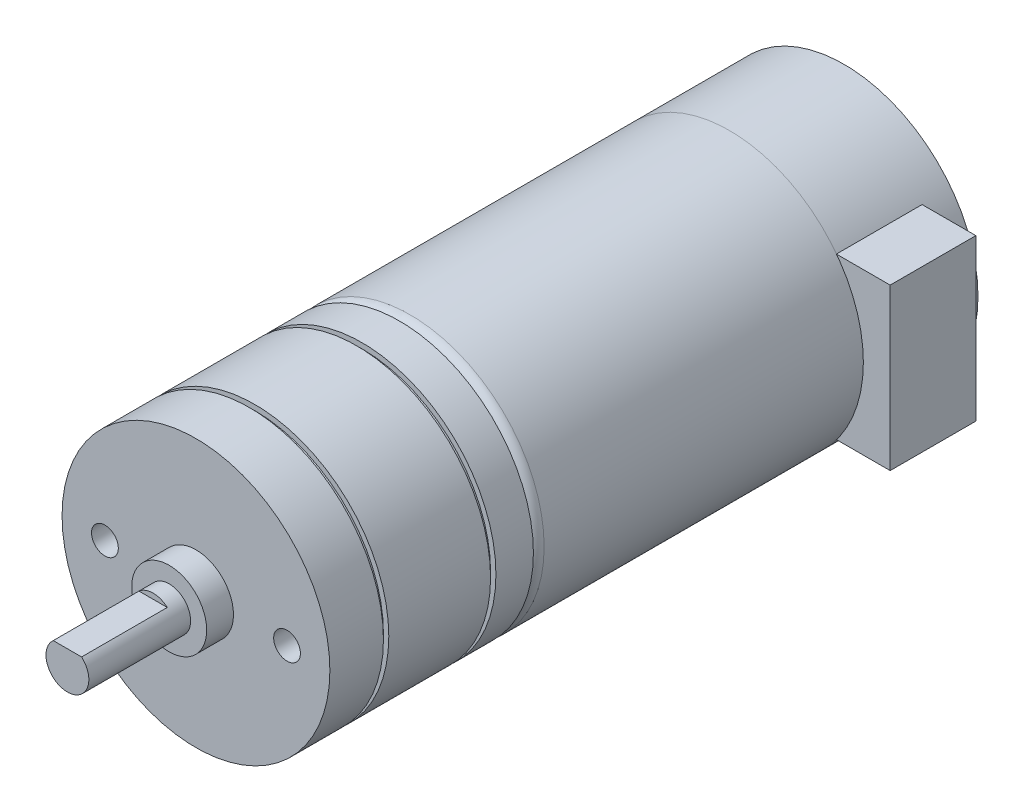
ISO-10303-21;
HEADER;
FILE_DESCRIPTION(('STEP AP214'),'2;1');
FILE_NAME('part.step','',(''),(''),'','','');
FILE_SCHEMA(('AUTOMOTIVE_DESIGN { 1 0 10303 214 1 1 1 1 }'));
ENDSEC;
DATA;
#1=APPLICATION_CONTEXT('core data for automotive mechanical design processes');
#2=APPLICATION_PROTOCOL_DEFINITION('international standard','automotive_design',2000,#1);
#3=PRODUCT_CONTEXT('',#1,'mechanical');
#4=PRODUCT('Part','Part','',(#3));
#5=PRODUCT_RELATED_PRODUCT_CATEGORY('part','',(#4));
#6=PRODUCT_DEFINITION_FORMATION('','',#4);
#7=PRODUCT_DEFINITION_CONTEXT('part definition',#1,'design');
#8=PRODUCT_DEFINITION('design','',#6,#7);
#9=PRODUCT_DEFINITION_SHAPE('','',#8);
#10=(LENGTH_UNIT() NAMED_UNIT(*) SI_UNIT(.MILLI.,.METRE.));
#11=(NAMED_UNIT(*) PLANE_ANGLE_UNIT() SI_UNIT($,.RADIAN.));
#12=(NAMED_UNIT(*) SI_UNIT($,.STERADIAN.) SOLID_ANGLE_UNIT());
#13=UNCERTAINTY_MEASURE_WITH_UNIT(LENGTH_MEASURE(1.E-05),#10,'distance_accuracy_value','');
#14=(GEOMETRIC_REPRESENTATION_CONTEXT(3) GLOBAL_UNCERTAINTY_ASSIGNED_CONTEXT((#13)) GLOBAL_UNIT_ASSIGNED_CONTEXT((#10,
#11,#12)) REPRESENTATION_CONTEXT('',''));
#15=CARTESIAN_POINT('',(0.,0.,0.));
#16=DIRECTION('',(0.,0.,1.));
#17=DIRECTION('',(1.,0.,0.));
#18=AXIS2_PLACEMENT_3D('',#15,#16,#17);
#19=CARTESIAN_POINT('',(0.,0.,52.3));
#20=DIRECTION('',(0.,0.,-1.));
#21=DIRECTION('',(-1.,0.,0.));
#22=AXIS2_PLACEMENT_3D('',#19,#20,#21);
#23=CYLINDRICAL_SURFACE('',#22,3.5);
#24=CARTESIAN_POINT('',(0.,0.,52.3));
#25=DIRECTION('',(0.,0.,1.));
#26=DIRECTION('',(1.,0.,0.));
#27=AXIS2_PLACEMENT_3D('',#24,#25,#26);
#28=CIRCLE('',#27,3.5);
#29=CARTESIAN_POINT('',(3.5,0.,52.3));
#30=VERTEX_POINT('',#29);
#31=EDGE_CURVE('E53',#30,#30,#28,.T.);
#32=ORIENTED_EDGE('',*,*,#31,.F.);
#33=EDGE_LOOP('',(#32));
#34=FACE_BOUND('',#33,.T.);
#35=CARTESIAN_POINT('',(0.,0.,49.8));
#36=DIRECTION('',(0.,0.,1.));
#37=DIRECTION('',(1.,0.,0.));
#38=AXIS2_PLACEMENT_3D('',#35,#36,#37);
#39=CIRCLE('',#38,3.5);
#40=CARTESIAN_POINT('',(3.5,0.,49.8));
#41=VERTEX_POINT('',#40);
#42=EDGE_CURVE('E48',#41,#41,#39,.T.);
#43=ORIENTED_EDGE('',*,*,#42,.T.);
#44=EDGE_LOOP('',(#43));
#45=FACE_BOUND('',#44,.T.);
#46=ADVANCED_FACE('F45',(#34,#45),#23,.T.);
#47=CARTESIAN_POINT('',(0.,0.,52.3));
#48=DIRECTION('',(0.,0.,1.));
#49=DIRECTION('',(1.,0.,0.));
#50=AXIS2_PLACEMENT_3D('',#47,#48,#49);
#51=PLANE('',#50);
#52=CARTESIAN_POINT('',(0.,0.,52.3));
#53=DIRECTION('',(0.,0.,1.));
#54=DIRECTION('',(1.,0.,0.));
#55=AXIS2_PLACEMENT_3D('',#52,#53,#54);
#56=CIRCLE('',#55,2.);
#57=CARTESIAN_POINT('',(2.,0.,52.3));
#58=VERTEX_POINT('',#57);
#59=EDGE_CURVE('E12',#58,#58,#56,.T.);
#60=ORIENTED_EDGE('',*,*,#59,.F.);
#61=EDGE_LOOP('',(#60));
#62=FACE_BOUND('',#61,.T.);
#63=ORIENTED_EDGE('',*,*,#31,.T.);
#64=EDGE_LOOP('',(#63));
#65=FACE_BOUND('',#64,.T.);
#66=ADVANCED_FACE('F92',(#62,#65),#51,.T.);
#67=CARTESIAN_POINT('',(0.,0.,49.8));
#68=DIRECTION('',(0.,0.,1.));
#69=DIRECTION('',(1.,0.,0.));
#70=AXIS2_PLACEMENT_3D('',#67,#68,#69);
#71=PLANE('',#70);
#72=ORIENTED_EDGE('',*,*,#42,.F.);
#73=EDGE_LOOP('',(#72));
#74=FACE_BOUND('',#73,.T.);
#75=ADVANCED_FACE('F98',(#74),#71,.F.);
#76=CARTESIAN_POINT('',(0.,0.,61.8));
#77=DIRECTION('',(0.,0.,-1.));
#78=DIRECTION('',(-1.,0.,0.));
#79=AXIS2_PLACEMENT_3D('',#76,#77,#78);
#80=CYLINDRICAL_SURFACE('',#79,2.);
#81=CARTESIAN_POINT('',(0.,0.,61.8));
#82=DIRECTION('',(0.,0.,1.));
#83=DIRECTION('',(1.,0.,0.));
#84=AXIS2_PLACEMENT_3D('',#81,#82,#83);
#85=CIRCLE('',#84,2.);
#86=CARTESIAN_POINT('',(-1.3228756555323,1.5,61.8));
#87=VERTEX_POINT('',#86);
#88=CARTESIAN_POINT('',(1.3228756555323,1.5,61.8));
#89=VERTEX_POINT('',#88);
#90=EDGE_CURVE('E83',#87,#89,#85,.T.);
#91=ORIENTED_EDGE('',*,*,#90,.F.);
#92=DIRECTION('',(0.,0.,1.));
#93=VECTOR('',#92,1.);
#94=CARTESIAN_POINT('',(-1.3228756555323,1.5,53.8));
#95=LINE('',#94,#93);
#96=CARTESIAN_POINT('',(-1.3228756555323,1.5,53.8));
#97=VERTEX_POINT('',#96);
#98=EDGE_CURVE('E61',#97,#87,#95,.T.);
#99=ORIENTED_EDGE('',*,*,#98,.F.);
#100=CARTESIAN_POINT('',(0.,0.,53.8));
#101=DIRECTION('',(0.,0.,1.));
#102=DIRECTION('',(1.,0.,0.));
#103=AXIS2_PLACEMENT_3D('',#100,#101,#102);
#104=CIRCLE('',#103,2.);
#105=CARTESIAN_POINT('',(1.3228756555323,1.5,53.8));
#106=VERTEX_POINT('',#105);
#107=EDGE_CURVE('E77',#106,#97,#104,.T.);
#108=ORIENTED_EDGE('',*,*,#107,.F.);
#109=DIRECTION('',(0.,0.,1.));
#110=VECTOR('',#109,1.);
#111=CARTESIAN_POINT('',(1.3228756555323,1.5,53.8));
#112=LINE('',#111,#110);
#113=EDGE_CURVE('E67',#106,#89,#112,.T.);
#114=ORIENTED_EDGE('',*,*,#113,.T.);
#115=EDGE_LOOP('',(#91,#99,#108,#114));
#116=FACE_BOUND('',#115,.T.);
#117=ORIENTED_EDGE('',*,*,#59,.T.);
#118=EDGE_LOOP('',(#117));
#119=FACE_BOUND('',#118,.T.);
#120=ADVANCED_FACE('F81',(#116,#119),#80,.T.);
#121=CARTESIAN_POINT('',(0.,0.,61.8));
#122=DIRECTION('',(0.,0.,1.));
#123=DIRECTION('',(1.,0.,0.));
#124=AXIS2_PLACEMENT_3D('',#121,#122,#123);
#125=PLANE('',#124);
#126=DIRECTION('',(1.,0.,0.));
#127=VECTOR('',#126,1.);
#128=CARTESIAN_POINT('',(0.,1.5,61.8));
#129=LINE('',#128,#127);
#130=EDGE_CURVE('E72',#87,#89,#129,.T.);
#131=ORIENTED_EDGE('',*,*,#130,.F.);
#132=ORIENTED_EDGE('',*,*,#90,.T.);
#133=EDGE_LOOP('',(#131,#132));
#134=FACE_BOUND('',#133,.T.);
#135=ADVANCED_FACE('F85',(#134),#125,.T.);
#136=CARTESIAN_POINT('',(0.,1.5,53.8));
#137=DIRECTION('',(0.,-1.,0.));
#138=DIRECTION('',(0.,0.,-1.));
#139=AXIS2_PLACEMENT_3D('',#136,#137,#138);
#140=PLANE('',#139);
#141=ORIENTED_EDGE('',*,*,#130,.T.);
#142=ORIENTED_EDGE('',*,*,#113,.F.);
#143=DIRECTION('',(1.,0.,0.));
#144=VECTOR('',#143,1.);
#145=CARTESIAN_POINT('',(0.,1.5,53.8));
#146=LINE('',#145,#144);
#147=EDGE_CURVE('E117',#97,#106,#146,.T.);
#148=ORIENTED_EDGE('',*,*,#147,.F.);
#149=ORIENTED_EDGE('',*,*,#98,.T.);
#150=EDGE_LOOP('',(#141,#142,#148,#149));
#151=FACE_BOUND('',#150,.T.);
#152=ADVANCED_FACE('F73',(#151),#140,.F.);
#153=CARTESIAN_POINT('',(0.,0.,53.8));
#154=DIRECTION('',(0.,0.,1.));
#155=DIRECTION('',(1.,0.,0.));
#156=AXIS2_PLACEMENT_3D('',#153,#154,#155);
#157=PLANE('',#156);
#158=ORIENTED_EDGE('',*,*,#107,.T.);
#159=ORIENTED_EDGE('',*,*,#147,.T.);
#160=EDGE_LOOP('',(#158,#159));
#161=FACE_BOUND('',#160,.T.);
#162=ADVANCED_FACE('F112',(#161),#157,.T.);
#163=CLOSED_SHELL('',(#46,#66,#75,#120,#135,#152,#162));
#164=MANIFOLD_SOLID_BREP('B2',#163);
#165=CARTESIAN_POINT('',(0.,0.,49.8));
#166=DIRECTION('',(0.,0.,-1.));
#167=DIRECTION('',(-1.,0.,0.));
#168=AXIS2_PLACEMENT_3D('',#165,#166,#167);
#169=CYLINDRICAL_SURFACE('',#168,12.5);
#170=CARTESIAN_POINT('',(0.,0.,34.8));
#171=DIRECTION('',(0.,0.,1.));
#172=DIRECTION('',(1.,0.,0.));
#173=AXIS2_PLACEMENT_3D('',#170,#171,#172);
#174=CIRCLE('',#173,12.5);
#175=CARTESIAN_POINT('',(12.5,0.,34.8));
#176=VERTEX_POINT('',#175);
#177=EDGE_CURVE('E222',#176,#176,#174,.T.);
#178=ORIENTED_EDGE('',*,*,#177,.T.);
#179=EDGE_LOOP('',(#178));
#180=FACE_BOUND('',#179,.T.);
#181=CARTESIAN_POINT('',(0.,0.,44.3));
#182=DIRECTION('',(0.,0.,1.));
#183=DIRECTION('',(1.,0.,0.));
#184=AXIS2_PLACEMENT_3D('',#181,#182,#183);
#185=CIRCLE('',#184,12.5);
#186=CARTESIAN_POINT('',(12.5,0.,44.3));
#187=VERTEX_POINT('',#186);
#188=EDGE_CURVE('E213',#187,#187,#185,.T.);
#189=ORIENTED_EDGE('',*,*,#188,.F.);
#190=EDGE_LOOP('',(#189));
#191=FACE_BOUND('',#190,.T.);
#192=ADVANCED_FACE('F171',(#180,#191),#169,.T.);
#193=CARTESIAN_POINT('',(0.,0.,30.8));
#194=DIRECTION('',(0.,0.,1.));
#195=DIRECTION('',(1.,0.,0.));
#196=AXIS2_PLACEMENT_3D('',#193,#194,#195);
#197=CIRCLE('',#196,12.5);
#198=CARTESIAN_POINT('',(12.5,0.,30.8));
#199=VERTEX_POINT('',#198);
#200=EDGE_CURVE('E175',#199,#199,#197,.T.);
#201=ORIENTED_EDGE('',*,*,#200,.T.);
#202=EDGE_LOOP('',(#201));
#203=FACE_BOUND('',#202,.T.);
#204=CARTESIAN_POINT('',(0.,0.,34.3));
#205=DIRECTION('',(0.,0.,1.));
#206=DIRECTION('',(1.,0.,0.));
#207=AXIS2_PLACEMENT_3D('',#204,#205,#206);
#208=CIRCLE('',#207,12.5);
#209=CARTESIAN_POINT('',(12.5,0.,34.3));
#210=VERTEX_POINT('',#209);
#211=EDGE_CURVE('E225',#210,#210,#208,.T.);
#212=ORIENTED_EDGE('',*,*,#211,.F.);
#213=EDGE_LOOP('',(#212));
#214=FACE_BOUND('',#213,.T.);
#215=ADVANCED_FACE('F251',(#203,#214),#169,.T.);
#216=CARTESIAN_POINT('',(0.,0.,30.8));
#217=DIRECTION('',(0.,0.,1.));
#218=DIRECTION('',(1.,0.,0.));
#219=AXIS2_PLACEMENT_3D('',#216,#217,#218);
#220=PLANE('',#219);
#221=ORIENTED_EDGE('',*,*,#200,.F.);
#222=EDGE_LOOP('',(#221));
#223=FACE_BOUND('',#222,.T.);
#224=ADVANCED_FACE('F246',(#223),#220,.F.);
#225=CARTESIAN_POINT('',(0.,0.,34.3));
#226=DIRECTION('',(0.,0.,1.));
#227=DIRECTION('',(1.,0.,0.));
#228=AXIS2_PLACEMENT_3D('',#225,#226,#227);
#229=PLANE('',#228);
#230=CARTESIAN_POINT('',(0.,0.,34.3));
#231=DIRECTION('',(0.,0.,1.));
#232=DIRECTION('',(1.,0.,0.));
#233=AXIS2_PLACEMENT_3D('',#230,#231,#232);
#234=CIRCLE('',#233,12.);
#235=CARTESIAN_POINT('',(12.,0.,34.3));
#236=VERTEX_POINT('',#235);
#237=EDGE_CURVE('E219',#236,#236,#234,.T.);
#238=ORIENTED_EDGE('',*,*,#237,.F.);
#239=EDGE_LOOP('',(#238));
#240=FACE_BOUND('',#239,.T.);
#241=ORIENTED_EDGE('',*,*,#211,.T.);
#242=EDGE_LOOP('',(#241));
#243=FACE_BOUND('',#242,.T.);
#244=ADVANCED_FACE('F236',(#240,#243),#229,.T.);
#245=CARTESIAN_POINT('',(0.,0.,34.8));
#246=DIRECTION('',(0.,0.,1.));
#247=DIRECTION('',(1.,0.,0.));
#248=AXIS2_PLACEMENT_3D('',#245,#246,#247);
#249=PLANE('',#248);
#250=CARTESIAN_POINT('',(0.,0.,34.8));
#251=DIRECTION('',(0.,0.,1.));
#252=DIRECTION('',(1.,0.,0.));
#253=AXIS2_PLACEMENT_3D('',#250,#251,#252);
#254=CIRCLE('',#253,12.);
#255=CARTESIAN_POINT('',(12.,0.,34.8));
#256=VERTEX_POINT('',#255);
#257=EDGE_CURVE('E216',#256,#256,#254,.T.);
#258=ORIENTED_EDGE('',*,*,#257,.T.);
#259=EDGE_LOOP('',(#258));
#260=FACE_BOUND('',#259,.T.);
#261=ORIENTED_EDGE('',*,*,#177,.F.);
#262=EDGE_LOOP('',(#261));
#263=FACE_BOUND('',#262,.T.);
#264=ADVANCED_FACE('F233',(#260,#263),#249,.F.);
#265=CARTESIAN_POINT('',(0.,0.,34.3));
#266=DIRECTION('',(0.,0.,1.));
#267=DIRECTION('',(1.,0.,0.));
#268=AXIS2_PLACEMENT_3D('',#265,#266,#267);
#269=CYLINDRICAL_SURFACE('',#268,12.);
#270=ORIENTED_EDGE('',*,*,#237,.T.);
#271=EDGE_LOOP('',(#270));
#272=FACE_BOUND('',#271,.T.);
#273=ORIENTED_EDGE('',*,*,#257,.F.);
#274=EDGE_LOOP('',(#273));
#275=FACE_BOUND('',#274,.T.);
#276=ADVANCED_FACE('F235',(#272,#275),#269,.T.);
#277=CARTESIAN_POINT('',(0.,0.,44.3));
#278=DIRECTION('',(0.,0.,1.));
#279=DIRECTION('',(1.,0.,0.));
#280=AXIS2_PLACEMENT_3D('',#277,#278,#279);
#281=PLANE('',#280);
#282=CARTESIAN_POINT('',(0.,0.,44.3));
#283=DIRECTION('',(0.,0.,1.));
#284=DIRECTION('',(1.,0.,0.));
#285=AXIS2_PLACEMENT_3D('',#282,#283,#284);
#286=CIRCLE('',#285,12.);
#287=CARTESIAN_POINT('',(12.,0.,44.3));
#288=VERTEX_POINT('',#287);
#289=EDGE_CURVE('E207',#288,#288,#286,.T.);
#290=ORIENTED_EDGE('',*,*,#289,.F.);
#291=EDGE_LOOP('',(#290));
#292=FACE_BOUND('',#291,.T.);
#293=ORIENTED_EDGE('',*,*,#188,.T.);
#294=EDGE_LOOP('',(#293));
#295=FACE_BOUND('',#294,.T.);
#296=ADVANCED_FACE('F243',(#292,#295),#281,.T.);
#297=CARTESIAN_POINT('',(0.,0.,44.8));
#298=DIRECTION('',(0.,0.,1.));
#299=DIRECTION('',(1.,0.,0.));
#300=AXIS2_PLACEMENT_3D('',#297,#298,#299);
#301=PLANE('',#300);
#302=CARTESIAN_POINT('',(0.,0.,44.8));
#303=DIRECTION('',(0.,0.,1.));
#304=DIRECTION('',(1.,0.,0.));
#305=AXIS2_PLACEMENT_3D('',#302,#303,#304);
#306=CIRCLE('',#305,12.);
#307=CARTESIAN_POINT('',(12.,0.,44.8));
#308=VERTEX_POINT('',#307);
#309=EDGE_CURVE('E206',#308,#308,#306,.T.);
#310=ORIENTED_EDGE('',*,*,#309,.T.);
#311=EDGE_LOOP('',(#310));
#312=FACE_BOUND('',#311,.T.);
#313=CARTESIAN_POINT('',(0.,0.,44.8));
#314=DIRECTION('',(0.,0.,1.));
#315=DIRECTION('',(1.,0.,0.));
#316=AXIS2_PLACEMENT_3D('',#313,#314,#315);
#317=CIRCLE('',#316,12.5);
#318=CARTESIAN_POINT('',(12.5,0.,44.8));
#319=VERTEX_POINT('',#318);
#320=EDGE_CURVE('E210',#319,#319,#317,.T.);
#321=ORIENTED_EDGE('',*,*,#320,.F.);
#322=EDGE_LOOP('',(#321));
#323=FACE_BOUND('',#322,.T.);
#324=ADVANCED_FACE('F272',(#312,#323),#301,.F.);
#325=CARTESIAN_POINT('',(0.,0.,44.3));
#326=DIRECTION('',(0.,0.,1.));
#327=DIRECTION('',(1.,0.,0.));
#328=AXIS2_PLACEMENT_3D('',#325,#326,#327);
#329=CYLINDRICAL_SURFACE('',#328,12.);
#330=ORIENTED_EDGE('',*,*,#289,.T.);
#331=EDGE_LOOP('',(#330));
#332=FACE_BOUND('',#331,.T.);
#333=ORIENTED_EDGE('',*,*,#309,.F.);
#334=EDGE_LOOP('',(#333));
#335=FACE_BOUND('',#334,.T.);
#336=ADVANCED_FACE('F265',(#332,#335),#329,.T.);
#337=CARTESIAN_POINT('',(0.,0.,49.8));
#338=DIRECTION('',(0.,0.,1.));
#339=DIRECTION('',(1.,0.,0.));
#340=AXIS2_PLACEMENT_3D('',#337,#338,#339);
#341=PLANE('',#340);
#342=CARTESIAN_POINT('',(-8.5,0.,49.8));
#343=DIRECTION('',(0.,0.,1.));
#344=DIRECTION('',(1.,0.,0.));
#345=AXIS2_PLACEMENT_3D('',#342,#343,#344);
#346=CIRCLE('',#345,1.24999999999999);
#347=CARTESIAN_POINT('',(-7.25000000000001,0.,49.8));
#348=VERTEX_POINT('',#347);
#349=EDGE_CURVE('E196',#348,#348,#346,.T.);
#350=ORIENTED_EDGE('',*,*,#349,.F.);
#351=EDGE_LOOP('',(#350));
#352=FACE_BOUND('',#351,.T.);
#353=CARTESIAN_POINT('',(8.5,0.,49.8));
#354=DIRECTION('',(0.,0.,1.));
#355=DIRECTION('',(1.,0.,0.));
#356=AXIS2_PLACEMENT_3D('',#353,#354,#355);
#357=CIRCLE('',#356,1.24999999999999);
#358=CARTESIAN_POINT('',(9.74999999999999,0.,49.8));
#359=VERTEX_POINT('',#358);
#360=EDGE_CURVE('E195',#359,#359,#357,.T.);
#361=ORIENTED_EDGE('',*,*,#360,.F.);
#362=EDGE_LOOP('',(#361));
#363=FACE_BOUND('',#362,.T.);
#364=CARTESIAN_POINT('',(0.,0.,49.8));
#365=DIRECTION('',(0.,0.,1.));
#366=DIRECTION('',(1.,0.,0.));
#367=AXIS2_PLACEMENT_3D('',#364,#365,#366);
#368=CIRCLE('',#367,12.5);
#369=CARTESIAN_POINT('',(12.5,0.,49.8));
#370=VERTEX_POINT('',#369);
#371=EDGE_CURVE('E43',#370,#370,#368,.T.);
#372=ORIENTED_EDGE('',*,*,#371,.T.);
#373=EDGE_LOOP('',(#372));
#374=FACE_BOUND('',#373,.T.);
#375=ADVANCED_FACE('F258',(#352,#363,#374),#341,.T.);
#376=ORIENTED_EDGE('',*,*,#320,.T.);
#377=EDGE_LOOP('',(#376));
#378=FACE_BOUND('',#377,.T.);
#379=ORIENTED_EDGE('',*,*,#371,.F.);
#380=EDGE_LOOP('',(#379));
#381=FACE_BOUND('',#380,.T.);
#382=ADVANCED_FACE('F173',(#378,#381),#169,.T.);
#383=CARTESIAN_POINT('',(8.5,0.,44.8));
#384=DIRECTION('',(0.,0.,1.));
#385=DIRECTION('',(1.,0.,0.));
#386=AXIS2_PLACEMENT_3D('',#383,#384,#385);
#387=CONICAL_SURFACE('',#386,1.25,1.02974425867665);
#388=CARTESIAN_POINT('',(8.5,0.,44.0489242262155));
#389=VERTEX_POINT('',#388);
#390=VERTEX_LOOP('',#389);
#391=FACE_BOUND('',#390,.T.);
#392=CARTESIAN_POINT('',(8.5,0.,44.8));
#393=DIRECTION('',(0.,0.,1.));
#394=DIRECTION('',(1.,0.,0.));
#395=AXIS2_PLACEMENT_3D('',#392,#393,#394);
#396=CIRCLE('',#395,1.25);
#397=CARTESIAN_POINT('',(9.75,0.,44.8));
#398=VERTEX_POINT('',#397);
#399=EDGE_CURVE('E199',#398,#398,#396,.T.);
#400=ORIENTED_EDGE('',*,*,#399,.T.);
#401=EDGE_LOOP('',(#400));
#402=FACE_BOUND('',#401,.T.);
#403=ADVANCED_FACE('F257',(#391,#402),#387,.F.);
#404=CARTESIAN_POINT('',(8.5,0.,49.8));
#405=DIRECTION('',(0.,0.,1.));
#406=DIRECTION('',(1.,0.,0.));
#407=AXIS2_PLACEMENT_3D('',#404,#405,#406);
#408=CYLINDRICAL_SURFACE('',#407,1.24999999999999);
#409=ORIENTED_EDGE('',*,*,#399,.F.);
#410=EDGE_LOOP('',(#409));
#411=FACE_BOUND('',#410,.T.);
#412=ORIENTED_EDGE('',*,*,#360,.T.);
#413=EDGE_LOOP('',(#412));
#414=FACE_BOUND('',#413,.T.);
#415=ADVANCED_FACE('F189',(#411,#414),#408,.F.);
#416=CARTESIAN_POINT('',(-8.5,0.,44.8));
#417=DIRECTION('',(0.,0.,1.));
#418=DIRECTION('',(1.,0.,0.));
#419=AXIS2_PLACEMENT_3D('',#416,#417,#418);
#420=CONICAL_SURFACE('',#419,1.25,1.02974425867665);
#421=CARTESIAN_POINT('',(-8.5,0.,44.0489242262155));
#422=VERTEX_POINT('',#421);
#423=VERTEX_LOOP('',#422);
#424=FACE_BOUND('',#423,.T.);
#425=CARTESIAN_POINT('',(-8.5,0.,44.8));
#426=DIRECTION('',(0.,0.,1.));
#427=DIRECTION('',(1.,0.,0.));
#428=AXIS2_PLACEMENT_3D('',#425,#426,#427);
#429=CIRCLE('',#428,1.25);
#430=CARTESIAN_POINT('',(-7.25,0.,44.8));
#431=VERTEX_POINT('',#430);
#432=EDGE_CURVE('E193',#431,#431,#429,.T.);
#433=ORIENTED_EDGE('',*,*,#432,.T.);
#434=EDGE_LOOP('',(#433));
#435=FACE_BOUND('',#434,.T.);
#436=ADVANCED_FACE('F185',(#424,#435),#420,.F.);
#437=CARTESIAN_POINT('',(-8.5,0.,49.8));
#438=DIRECTION('',(0.,0.,1.));
#439=DIRECTION('',(1.,0.,0.));
#440=AXIS2_PLACEMENT_3D('',#437,#438,#439);
#441=CYLINDRICAL_SURFACE('',#440,1.24999999999999);
#442=ORIENTED_EDGE('',*,*,#432,.F.);
#443=EDGE_LOOP('',(#442));
#444=FACE_BOUND('',#443,.T.);
#445=ORIENTED_EDGE('',*,*,#349,.T.);
#446=EDGE_LOOP('',(#445));
#447=FACE_BOUND('',#446,.T.);
#448=ADVANCED_FACE('F188',(#444,#447),#441,.F.);
#449=CLOSED_SHELL('',(#192,#215,#224,#244,#264,#276,#296,#324,#336,#375,#382,#403,#415,#436,#448));
#450=MANIFOLD_SOLID_BREP('B6',#449);
#451=CARTESIAN_POINT('',(15.,-7.5,0.));
#452=DIRECTION('',(0.,0.,-1.));
#453=DIRECTION('',(-1.,0.,0.));
#454=AXIS2_PLACEMENT_3D('',#451,#452,#453);
#455=PLANE('',#454);
#456=DIRECTION('',(0.,-1.,0.));
#457=VECTOR('',#456,1.);
#458=CARTESIAN_POINT('',(0.,-7.5,0.));
#459=LINE('',#458,#457);
#460=CARTESIAN_POINT('',(0.,7.5,0.));
#461=VERTEX_POINT('',#460);
#462=CARTESIAN_POINT('',(0.,-7.5,0.));
#463=VERTEX_POINT('',#462);
#464=EDGE_CURVE('E466',#461,#463,#459,.T.);
#465=ORIENTED_EDGE('',*,*,#464,.T.);
#466=DIRECTION('',(-1.,0.,0.));
#467=VECTOR('',#466,1.);
#468=CARTESIAN_POINT('',(15.,-7.5,0.));
#469=LINE('',#468,#467);
#470=CARTESIAN_POINT('',(15.,-7.5,0.));
#471=VERTEX_POINT('',#470);
#472=EDGE_CURVE('E169',#471,#463,#469,.T.);
#473=ORIENTED_EDGE('',*,*,#472,.F.);
#474=DIRECTION('',(0.,-1.,0.));
#475=VECTOR('',#474,1.);
#476=CARTESIAN_POINT('',(15.,-7.5,0.));
#477=LINE('',#476,#475);
#478=CARTESIAN_POINT('',(15.,7.5,0.));
#479=VERTEX_POINT('',#478);
#480=EDGE_CURVE('E454',#479,#471,#477,.T.);
#481=ORIENTED_EDGE('',*,*,#480,.F.);
#482=DIRECTION('',(-1.,0.,0.));
#483=VECTOR('',#482,1.);
#484=CARTESIAN_POINT('',(15.,7.5,0.));
#485=LINE('',#484,#483);
#486=EDGE_CURVE('E462',#479,#461,#485,.T.);
#487=ORIENTED_EDGE('',*,*,#486,.T.);
#488=EDGE_LOOP('',(#465,#473,#481,#487));
#489=FACE_BOUND('',#488,.T.);
#490=ADVANCED_FACE('F403',(#489),#455,.F.);
#491=CARTESIAN_POINT('',(15.,-7.5,0.));
#492=DIRECTION('',(0.,1.,0.));
#493=DIRECTION('',(0.,0.,1.));
#494=AXIS2_PLACEMENT_3D('',#491,#492,#493);
#495=PLANE('',#494);
#496=DIRECTION('',(0.,0.,-1.));
#497=VECTOR('',#496,1.);
#498=CARTESIAN_POINT('',(0.,-7.5,0.));
#499=LINE('',#498,#497);
#500=CARTESIAN_POINT('',(0.,-7.5,-8.));
#501=VERTEX_POINT('',#500);
#502=EDGE_CURVE('E458',#463,#501,#499,.T.);
#503=ORIENTED_EDGE('',*,*,#502,.T.);
#504=DIRECTION('',(-1.,0.,0.));
#505=VECTOR('',#504,1.);
#506=CARTESIAN_POINT('',(15.,-7.5,-8.));
#507=LINE('',#506,#505);
#508=CARTESIAN_POINT('',(15.,-7.5,-8.));
#509=VERTEX_POINT('',#508);
#510=EDGE_CURVE('E411',#509,#501,#507,.T.);
#511=ORIENTED_EDGE('',*,*,#510,.F.);
#512=DIRECTION('',(0.,0.,-1.));
#513=VECTOR('',#512,1.);
#514=CARTESIAN_POINT('',(15.,-7.5,0.));
#515=LINE('',#514,#513);
#516=EDGE_CURVE('E449',#471,#509,#515,.T.);
#517=ORIENTED_EDGE('',*,*,#516,.F.);
#518=ORIENTED_EDGE('',*,*,#472,.T.);
#519=EDGE_LOOP('',(#503,#511,#517,#518));
#520=FACE_BOUND('',#519,.T.);
#521=ADVANCED_FACE('F457',(#520),#495,.F.);
#522=CARTESIAN_POINT('',(15.,-7.5,-8.));
#523=DIRECTION('',(0.,0.,1.));
#524=DIRECTION('',(1.,0.,0.));
#525=AXIS2_PLACEMENT_3D('',#522,#523,#524);
#526=PLANE('',#525);
#527=DIRECTION('',(0.,1.,0.));
#528=VECTOR('',#527,1.);
#529=CARTESIAN_POINT('',(0.,-7.5,-8.));
#530=LINE('',#529,#528);
#531=CARTESIAN_POINT('',(0.,7.5,-8.));
#532=VERTEX_POINT('',#531);
#533=EDGE_CURVE('E436',#501,#532,#530,.T.);
#534=ORIENTED_EDGE('',*,*,#533,.T.);
#535=DIRECTION('',(-1.,0.,0.));
#536=VECTOR('',#535,1.);
#537=CARTESIAN_POINT('',(15.,7.5,-8.));
#538=LINE('',#537,#536);
#539=CARTESIAN_POINT('',(15.,7.5,-8.));
#540=VERTEX_POINT('',#539);
#541=EDGE_CURVE('E459',#540,#532,#538,.T.);
#542=ORIENTED_EDGE('',*,*,#541,.F.);
#543=DIRECTION('',(0.,1.,0.));
#544=VECTOR('',#543,1.);
#545=CARTESIAN_POINT('',(15.,-7.5,-8.));
#546=LINE('',#545,#544);
#547=EDGE_CURVE('E452',#509,#540,#546,.T.);
#548=ORIENTED_EDGE('',*,*,#547,.F.);
#549=ORIENTED_EDGE('',*,*,#510,.T.);
#550=EDGE_LOOP('',(#534,#542,#548,#549));
#551=FACE_BOUND('',#550,.T.);
#552=ADVANCED_FACE('F460',(#551),#526,.F.);
#553=CARTESIAN_POINT('',(15.,7.5,0.));
#554=DIRECTION('',(0.,-1.,0.));
#555=DIRECTION('',(0.,0.,-1.));
#556=AXIS2_PLACEMENT_3D('',#553,#554,#555);
#557=PLANE('',#556);
#558=DIRECTION('',(0.,0.,1.));
#559=VECTOR('',#558,1.);
#560=CARTESIAN_POINT('',(0.,7.5,0.));
#561=LINE('',#560,#559);
#562=EDGE_CURVE('E442',#532,#461,#561,.T.);
#563=ORIENTED_EDGE('',*,*,#562,.T.);
#564=ORIENTED_EDGE('',*,*,#486,.F.);
#565=DIRECTION('',(0.,0.,1.));
#566=VECTOR('',#565,1.);
#567=CARTESIAN_POINT('',(15.,7.5,0.));
#568=LINE('',#567,#566);
#569=EDGE_CURVE('E419',#540,#479,#568,.T.);
#570=ORIENTED_EDGE('',*,*,#569,.F.);
#571=ORIENTED_EDGE('',*,*,#541,.T.);
#572=EDGE_LOOP('',(#563,#564,#570,#571));
#573=FACE_BOUND('',#572,.T.);
#574=ADVANCED_FACE('F473',(#573),#557,.F.);
#575=CARTESIAN_POINT('',(15.,0.,0.));
#576=DIRECTION('',(-1.,0.,0.));
#577=DIRECTION('',(0.,0.,1.));
#578=AXIS2_PLACEMENT_3D('',#575,#576,#577);
#579=PLANE('',#578);
#580=ORIENTED_EDGE('',*,*,#480,.T.);
#581=ORIENTED_EDGE('',*,*,#516,.T.);
#582=ORIENTED_EDGE('',*,*,#547,.T.);
#583=ORIENTED_EDGE('',*,*,#569,.T.);
#584=EDGE_LOOP('',(#580,#581,#582,#583));
#585=FACE_BOUND('',#584,.T.);
#586=ADVANCED_FACE('F450',(#585),#579,.F.);
#587=CARTESIAN_POINT('',(0.,0.,0.));
#588=DIRECTION('',(-1.,0.,0.));
#589=DIRECTION('',(0.,0.,1.));
#590=AXIS2_PLACEMENT_3D('',#587,#588,#589);
#591=PLANE('',#590);
#592=ORIENTED_EDGE('',*,*,#464,.F.);
#593=ORIENTED_EDGE('',*,*,#562,.F.);
#594=ORIENTED_EDGE('',*,*,#533,.F.);
#595=ORIENTED_EDGE('',*,*,#502,.F.);
#596=EDGE_LOOP('',(#592,#593,#594,#595));
#597=FACE_BOUND('',#596,.T.);
#598=ADVANCED_FACE('F476',(#597),#591,.T.);
#599=CLOSED_SHELL('',(#490,#521,#552,#574,#586,#598));
#600=MANIFOLD_SOLID_BREP('B37',#599);
#601=CARTESIAN_POINT('',(0.,0.,-10.7));
#602=DIRECTION('',(0.,0.,1.));
#603=DIRECTION('',(1.,0.,0.));
#604=AXIS2_PLACEMENT_3D('',#601,#602,#603);
#605=CYLINDRICAL_SURFACE('',#604,12.5);
#606=CARTESIAN_POINT('',(0.,0.,-10.7));
#607=DIRECTION('',(0.,0.,-1.));
#608=DIRECTION('',(-1.,0.,0.));
#609=AXIS2_PLACEMENT_3D('',#606,#607,#608);
#610=CIRCLE('',#609,12.5);
#611=CARTESIAN_POINT('',(-12.5,0.,-10.7));
#612=VERTEX_POINT('',#611);
#613=EDGE_CURVE('E402',#612,#612,#610,.T.);
#614=ORIENTED_EDGE('',*,*,#613,.F.);
#615=EDGE_LOOP('',(#614));
#616=FACE_BOUND('',#615,.T.);
#617=CARTESIAN_POINT('',(0.,0.,0.));
#618=DIRECTION('',(0.,0.,-1.));
#619=DIRECTION('',(-1.,0.,0.));
#620=AXIS2_PLACEMENT_3D('',#617,#618,#619);
#621=CIRCLE('',#620,12.5);
#622=CARTESIAN_POINT('',(-12.5,0.,0.));
#623=VERTEX_POINT('',#622);
#624=EDGE_CURVE('E536',#623,#623,#621,.T.);
#625=ORIENTED_EDGE('',*,*,#624,.T.);
#626=EDGE_LOOP('',(#625));
#627=FACE_BOUND('',#626,.T.);
#628=ADVANCED_FACE('F533',(#616,#627),#605,.T.);
#629=CARTESIAN_POINT('',(0.,0.,-10.7));
#630=DIRECTION('',(0.,0.,-1.));
#631=DIRECTION('',(-1.,0.,0.));
#632=AXIS2_PLACEMENT_3D('',#629,#630,#631);
#633=PLANE('',#632);
#634=ORIENTED_EDGE('',*,*,#613,.T.);
#635=EDGE_LOOP('',(#634));
#636=FACE_BOUND('',#635,.T.);
#637=ADVANCED_FACE('F548',(#636),#633,.T.);
#638=CARTESIAN_POINT('',(0.,0.,0.));
#639=DIRECTION('',(0.,0.,-1.));
#640=DIRECTION('',(-1.,0.,0.));
#641=AXIS2_PLACEMENT_3D('',#638,#639,#640);
#642=PLANE('',#641);
#643=ORIENTED_EDGE('',*,*,#624,.F.);
#644=EDGE_LOOP('',(#643));
#645=FACE_BOUND('',#644,.T.);
#646=ADVANCED_FACE('F546',(#645),#642,.F.);
#647=CLOSED_SHELL('',(#628,#637,#646));
#648=MANIFOLD_SOLID_BREP('B163',#647);
#649=CARTESIAN_POINT('',(0.,0.,30.8));
#650=DIRECTION('',(0.,0.,-1.));
#651=DIRECTION('',(-1.,0.,0.));
#652=AXIS2_PLACEMENT_3D('',#649,#650,#651);
#653=CYLINDRICAL_SURFACE('',#652,12.5);
#654=CARTESIAN_POINT('',(0.,0.,29.8));
#655=DIRECTION('',(0.,0.,1.));
#656=DIRECTION('',(1.,0.,0.));
#657=AXIS2_PLACEMENT_3D('',#654,#655,#656);
#658=CIRCLE('',#657,12.5);
#659=CARTESIAN_POINT('',(12.5,0.,29.8));
#660=VERTEX_POINT('',#659);
#661=EDGE_CURVE('E532',#660,#660,#658,.F.);
#662=ORIENTED_EDGE('',*,*,#661,.T.);
#663=EDGE_LOOP('',(#662));
#664=FACE_BOUND('',#663,.T.);
#665=CARTESIAN_POINT('',(0.,0.,0.));
#666=DIRECTION('',(0.,0.,1.));
#667=DIRECTION('',(1.,0.,0.));
#668=AXIS2_PLACEMENT_3D('',#665,#666,#667);
#669=CIRCLE('',#668,12.5);
#670=CARTESIAN_POINT('',(12.5,0.,0.));
#671=VERTEX_POINT('',#670);
#672=EDGE_CURVE('E584',#671,#671,#669,.T.);
#673=ORIENTED_EDGE('',*,*,#672,.T.);
#674=EDGE_LOOP('',(#673));
#675=FACE_BOUND('',#674,.T.);
#676=ADVANCED_FACE('F573',(#664,#675),#653,.T.);
#677=CARTESIAN_POINT('',(0.,0.,30.8));
#678=DIRECTION('',(0.,0.,1.));
#679=DIRECTION('',(1.,0.,0.));
#680=AXIS2_PLACEMENT_3D('',#677,#678,#679);
#681=PLANE('',#680);
#682=CARTESIAN_POINT('',(0.,0.,30.8));
#683=DIRECTION('',(0.,0.,1.));
#684=DIRECTION('',(1.,0.,0.));
#685=AXIS2_PLACEMENT_3D('',#682,#683,#684);
#686=CIRCLE('',#685,11.5);
#687=CARTESIAN_POINT('',(11.5,0.,30.8));
#688=VERTEX_POINT('',#687);
#689=EDGE_CURVE('E580',#688,#688,#686,.T.);
#690=ORIENTED_EDGE('',*,*,#689,.T.);
#691=EDGE_LOOP('',(#690));
#692=FACE_BOUND('',#691,.T.);
#693=ADVANCED_FACE('F594',(#692),#681,.T.);
#694=CARTESIAN_POINT('',(0.,0.,0.));
#695=DIRECTION('',(0.,0.,1.));
#696=DIRECTION('',(1.,0.,0.));
#697=AXIS2_PLACEMENT_3D('',#694,#695,#696);
#698=PLANE('',#697);
#699=ORIENTED_EDGE('',*,*,#672,.F.);
#700=EDGE_LOOP('',(#699));
#701=FACE_BOUND('',#700,.T.);
#702=ADVANCED_FACE('F592',(#701),#698,.F.);
#703=CARTESIAN_POINT('',(0.,0.,29.8));
#704=DIRECTION('',(0.,0.,1.));
#705=DIRECTION('',(1.,0.,0.));
#706=AXIS2_PLACEMENT_3D('',#703,#704,#705);
#707=TOROIDAL_SURFACE('',#706,11.5,1.);
#708=ORIENTED_EDGE('',*,*,#661,.F.);
#709=EDGE_LOOP('',(#708));
#710=FACE_BOUND('',#709,.T.);
#711=ORIENTED_EDGE('',*,*,#689,.F.);
#712=EDGE_LOOP('',(#711));
#713=FACE_BOUND('',#712,.T.);
#714=ADVANCED_FACE('F575',(#710,#713),#707,.T.);
#715=CLOSED_SHELL('',(#676,#693,#702,#714));
#716=MANIFOLD_SOLID_BREP('B397',#715);
#717=ADVANCED_BREP_SHAPE_REPRESENTATION('',(#18,#164,#450,#600,#648,#716),#14);
#718=SHAPE_DEFINITION_REPRESENTATION(#9,#717);
ENDSEC;
END-ISO-10303-21;
